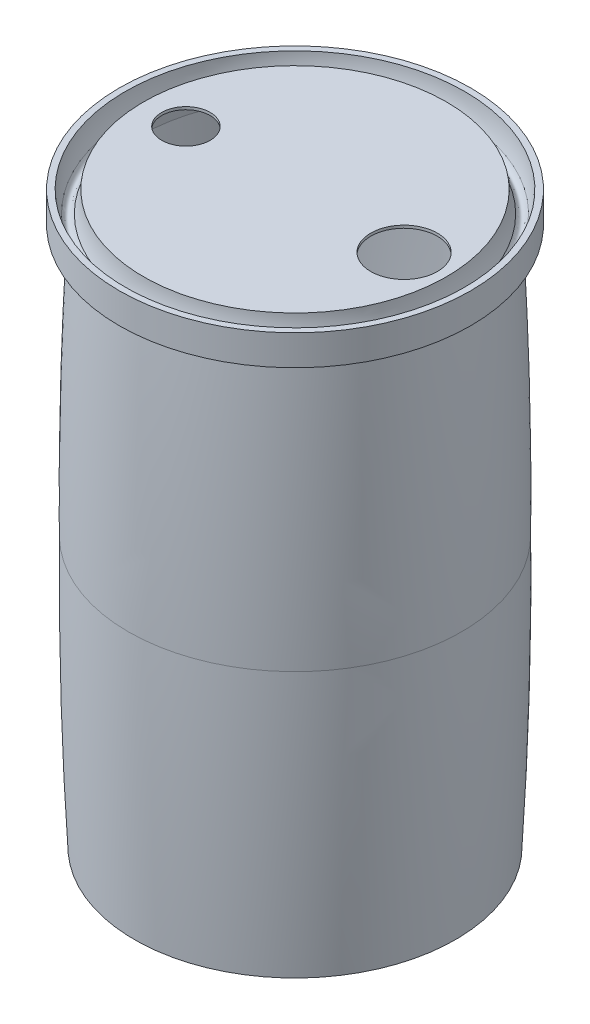
ISO-10303-21;
HEADER;
FILE_DESCRIPTION(('STEP AP214'),'2;1');
FILE_NAME('part.step','',(''),(''),'','','');
FILE_SCHEMA(('AUTOMOTIVE_DESIGN { 1 0 10303 214 1 1 1 1 }'));
ENDSEC;
DATA;
#1=APPLICATION_CONTEXT('core data for automotive mechanical design processes');
#2=APPLICATION_PROTOCOL_DEFINITION('international standard','automotive_design',2000,#1);
#3=PRODUCT_CONTEXT('',#1,'mechanical');
#4=PRODUCT('Part','Part','',(#3));
#5=PRODUCT_RELATED_PRODUCT_CATEGORY('part','',(#4));
#6=PRODUCT_DEFINITION_FORMATION('','',#4);
#7=PRODUCT_DEFINITION_CONTEXT('part definition',#1,'design');
#8=PRODUCT_DEFINITION('design','',#6,#7);
#9=PRODUCT_DEFINITION_SHAPE('','',#8);
#10=(LENGTH_UNIT() NAMED_UNIT(*) SI_UNIT(.MILLI.,.METRE.));
#11=(NAMED_UNIT(*) PLANE_ANGLE_UNIT() SI_UNIT($,.RADIAN.));
#12=(NAMED_UNIT(*) SI_UNIT($,.STERADIAN.) SOLID_ANGLE_UNIT());
#13=UNCERTAINTY_MEASURE_WITH_UNIT(LENGTH_MEASURE(1.E-05),#10,'distance_accuracy_value','');
#14=(GEOMETRIC_REPRESENTATION_CONTEXT(3) GLOBAL_UNCERTAINTY_ASSIGNED_CONTEXT((#13)) GLOBAL_UNIT_ASSIGNED_CONTEXT((#10,
#11,#12)) REPRESENTATION_CONTEXT('',''));
#15=CARTESIAN_POINT('',(0.,0.,0.));
#16=DIRECTION('',(0.,0.,1.));
#17=DIRECTION('',(1.,0.,0.));
#18=AXIS2_PLACEMENT_3D('',#15,#16,#17);
#19=CARTESIAN_POINT('',(255.01443726438,889.462843735034,0.));
#20=CARTESIAN_POINT('',(257.005357596865,852.452273109145,0.));
#21=CARTESIAN_POINT('',(260.409385389881,778.387955646829,0.));
#22=CARTESIAN_POINT('',(263.774793279568,667.290811370886,0.));
#23=CARTESIAN_POINT('',(265.401957490092,556.163604753236,0.));
#24=CARTESIAN_POINT('',(265.326354988854,482.050777888006,0.));
#25=CARTESIAN_POINT('',(264.999611150349,445.,0.));
#26=B_SPLINE_CURVE_WITH_KNOTS('',3,(#19,#20,#21,#22,#23,#24,#25),.UNSPECIFIED.,.F.,.F.,(4,1,1,1,
4),(0.,0.250049517714542,0.500099035429085,0.750148553143627,1.00019807085817),.UNSPECIFIED.);
#27=CARTESIAN_POINT('',(0.,0.,0.));
#28=DIRECTION('',(0.,-1.,0.));
#29=AXIS1_PLACEMENT('',#27,#28);
#30=SURFACE_OF_REVOLUTION('',#26,#29);
#31=CARTESIAN_POINT('',(0.,889.462843735034,0.));
#32=DIRECTION('',(0.,-1.,0.));
#33=DIRECTION('',(0.,0.,-1.));
#34=AXIS2_PLACEMENT_3D('',#31,#32,#33);
#35=CIRCLE('',#34,255.01443726438);
#36=CARTESIAN_POINT('',(0.,889.462843735034,-255.01443726438));
#37=VERTEX_POINT('',#36);
#38=EDGE_CURVE('E118',#37,#37,#35,.T.);
#39=ORIENTED_EDGE('',*,*,#38,.F.);
#40=EDGE_LOOP('',(#39));
#41=FACE_BOUND('',#40,.T.);
#42=CARTESIAN_POINT('',(0.,445.,0.));
#43=DIRECTION('',(0.,-1.,0.));
#44=DIRECTION('',(0.,0.,-1.));
#45=AXIS2_PLACEMENT_3D('',#42,#43,#44);
#46=CIRCLE('',#45,264.999611150349);
#47=CARTESIAN_POINT('',(0.,445.,-264.999611150349));
#48=VERTEX_POINT('',#47);
#49=EDGE_CURVE('E10',#48,#48,#46,.T.);
#50=ORIENTED_EDGE('',*,*,#49,.T.);
#51=EDGE_LOOP('',(#50));
#52=FACE_BOUND('',#51,.T.);
#53=CARTESIAN_POINT('',(-258.947815801606,780.,24.));
#54=CARTESIAN_POINT('',(-258.921939047419,780.671764485429,24.0000065439636));
#55=CARTESIAN_POINT('',(-258.898588919757,781.343526066716,23.9717853404909));
#56=CARTESIAN_POINT('',(-258.857040914579,782.682685721883,23.8590584591823));
#57=CARTESIAN_POINT('',(-258.838844258748,783.350082724524,23.7745394512465));
#58=CARTESIAN_POINT('',(-258.807576865088,784.676192894501,23.5496499263443));
#59=CARTESIAN_POINT('',(-258.794511257048,785.334896738401,23.4092237969048));
#60=CARTESIAN_POINT('',(-258.773368396006,786.638216076008,23.0735103044504));
#61=CARTESIAN_POINT('',(-258.765290846014,787.282832406284,22.8782262086985));
#62=CARTESIAN_POINT('',(-258.753831161898,788.553128541564,22.4342703120425));
#63=CARTESIAN_POINT('',(-258.750446932169,789.178816676006,22.1856223958235));
#64=CARTESIAN_POINT('',(-258.74795367358,790.407113948842,21.6366473030262));
#65=CARTESIAN_POINT('',(-258.748844705777,791.009722757504,21.3363193884367));
#66=CARTESIAN_POINT('',(-258.754384917711,792.187445625968,20.686190995988));
#67=CARTESIAN_POINT('',(-258.759033287218,792.76256558513,20.3364011974674));
#68=CARTESIAN_POINT('',(-258.771486394105,793.88137754163,19.5897843786426));
#69=CARTESIAN_POINT('',(-258.77929112387,794.425069614792,19.1929574718263));
#70=CARTESIAN_POINT('',(-258.797401932908,795.477726657492,18.3546493170213));
#71=CARTESIAN_POINT('',(-258.807710557834,795.986655605179,17.9131228921962));
#72=CARTESIAN_POINT('',(-258.830117309769,796.965584390079,16.9888810516313));
#73=CARTESIAN_POINT('',(-258.842215439165,797.435584175363,16.5061655809497));
#74=CARTESIAN_POINT('',(-258.867475769452,798.333359619019,15.502937184282));
#75=CARTESIAN_POINT('',(-258.880638016064,798.761133461411,14.982422634368));
#76=CARTESIAN_POINT('',(-258.907305059461,799.571418669379,13.9072891527074));
#77=CARTESIAN_POINT('',(-258.920809856691,799.953929976408,13.3526701768473));
#78=CARTESIAN_POINT('',(-258.947498891383,800.671806133094,12.2119453666771));
#79=CARTESIAN_POINT('',(-258.960682331022,801.007061917123,11.6257708723527));
#80=CARTESIAN_POINT('',(-258.986048294152,801.627013764886,10.4272468517763));
#81=CARTESIAN_POINT('',(-258.998230816053,801.911709748395,9.81489728399358));
#82=CARTESIAN_POINT('',(-259.021016323682,802.428514921092,8.56836891816433));
#83=CARTESIAN_POINT('',(-259.03161931503,802.66062429745,7.93419019782246));
#84=CARTESIAN_POINT('',(-259.050755070183,803.070601252303,6.64850535950412));
#85=CARTESIAN_POINT('',(-259.059287835659,803.248468874598,5.99699925551989));
#86=CARTESIAN_POINT('',(-259.073894363028,803.548667165585,4.68139287285837));
#87=CARTESIAN_POINT('',(-259.079968501734,803.671006345024,4.01729454043522));
#88=CARTESIAN_POINT('',(-259.089387219682,803.859310953915,2.68113344396124));
#89=CARTESIAN_POINT('',(-259.092731798776,803.925276380291,2.00907067947562));
#90=CARTESIAN_POINT('',(-259.09654249486,804.000359632836,0.661774268711117));
#91=CARTESIAN_POINT('',(-259.097008634874,804.009477913676,-0.0134593521635951));
#92=CARTESIAN_POINT('',(-259.095041819144,803.970802550008,-1.36229012583803));
#93=CARTESIAN_POINT('',(-259.092608865612,803.92300894892,-2.03588727988589));
#94=CARTESIAN_POINT('',(-259.084956310769,803.770938179847,-3.37589688450344));
#95=CARTESIAN_POINT('',(-259.079739821827,803.666724095697,-4.04231651312696));
#96=CARTESIAN_POINT('',(-259.066754925275,803.402599447736,-5.36399951195408));
#97=CARTESIAN_POINT('',(-259.058986519607,803.242688926311,-6.01926289064721));
#98=CARTESIAN_POINT('',(-259.041248138299,802.868312095427,-7.3139882047651));
#99=CARTESIAN_POINT('',(-259.031278148694,802.653845439903,-7.9534500399277));
#100=CARTESIAN_POINT('',(-259.009593812238,802.171884309843,-9.21203720636839));
#101=CARTESIAN_POINT('',(-258.997879463823,801.904389787792,-9.83116251942321));
#102=CARTESIAN_POINT('',(-258.973248904952,801.318099226006,-11.0450546573477));
#103=CARTESIAN_POINT('',(-258.960331986115,800.999272867285,-11.6398068242253));
#104=CARTESIAN_POINT('',(-258.933928706047,800.312693674615,-12.8003531679054));
#105=CARTESIAN_POINT('',(-258.920442344606,799.944940822704,-13.3661473340764));
#106=CARTESIAN_POINT('',(-258.893582975614,799.163109713066,-14.464777610879));
#107=CARTESIAN_POINT('',(-258.880209968899,798.749031113674,-14.9976134783901));
#108=CARTESIAN_POINT('',(-258.85429539049,797.877479509701,-16.0265500003536));
#109=CARTESIAN_POINT('',(-258.841753819208,797.420006483585,-16.522650636577));
#110=CARTESIAN_POINT('',(-258.818221440539,796.464448625479,-17.4750507911226));
#111=CARTESIAN_POINT('',(-258.807232113539,795.966325730104,-17.9313121582512));
#112=CARTESIAN_POINT('',(-258.787540018668,794.933377491121,-18.8002592870359));
#113=CARTESIAN_POINT('',(-258.778837252577,794.39855211893,-19.212945014756));
#114=CARTESIAN_POINT('',(-258.764405609917,793.296004555801,-19.9917936094221));
#115=CARTESIAN_POINT('',(-258.75867670607,792.728282666651,-20.3579569030596));
#116=CARTESIAN_POINT('',(-258.750822468704,791.563982265463,-21.0411477305917));
#117=CARTESIAN_POINT('',(-258.74869712902,790.967403802794,-21.3581753485468));
#118=CARTESIAN_POINT('',(-258.7486005924,789.750559141283,-21.9403929009754));
#119=CARTESIAN_POINT('',(-258.750623209448,789.130329568148,-22.2056593827863));
#120=CARTESIAN_POINT('',(-258.759259657612,787.869776251513,-22.6830519166078));
#121=CARTESIAN_POINT('',(-258.765873484381,787.229452527038,-22.8951780189268));
#122=CARTESIAN_POINT('',(-258.784026249574,785.933302471756,-23.2647816955471));
#123=CARTESIAN_POINT('',(-258.795565104474,785.277476404029,-23.4222601965311));
#124=CARTESIAN_POINT('',(-258.823772842072,783.955007409313,-23.6814683462965));
#125=CARTESIAN_POINT('',(-258.840441717651,783.288364497331,-23.7831980724247));
#126=CARTESIAN_POINT('',(-258.878932331727,781.950534328884,-23.9300489492559));
#127=CARTESIAN_POINT('',(-258.900742447575,781.279360591796,-23.9752963561848));
#128=CARTESIAN_POINT('',(-258.949457901682,779.935769926036,-24.0093205311536));
#129=CARTESIAN_POINT('',(-258.976363230608,779.263352999644,-23.9980974026402));
#130=CARTESIAN_POINT('',(-259.03504788752,777.922040285301,-23.9193105931978));
#131=CARTESIAN_POINT('',(-259.066827238782,777.253144514182,-23.8517466431938));
#132=CARTESIAN_POINT('',(-259.134898118908,775.923599287184,-23.6608114319911));
#133=CARTESIAN_POINT('',(-259.171189657623,775.262949849314,-23.5374400489326));
#134=CARTESIAN_POINT('',(-259.247849769012,773.953526013005,-23.2355821781526));
#135=CARTESIAN_POINT('',(-259.288224567957,773.304771587223,-23.0570106404465));
#136=CARTESIAN_POINT('',(-259.372385546644,772.024739780708,-22.6461267058711));
#137=CARTESIAN_POINT('',(-259.416171728509,771.393462410855,-22.4138142755476));
#138=CARTESIAN_POINT('',(-259.506430673974,770.152771000953,-21.8971155128121));
#139=CARTESIAN_POINT('',(-259.552903512955,769.543357575147,-21.6127277187702));
#140=CARTESIAN_POINT('',(-259.64771867574,768.350646727052,-20.9939026831849));
#141=CARTESIAN_POINT('',(-259.696061006598,767.767349403329,-20.6594652527671));
#142=CARTESIAN_POINT('',(-259.79397094675,766.628097322063,-19.9411118695568));
#143=CARTESIAN_POINT('',(-259.843543442737,766.072292472004,-19.5569588169514));
#144=CARTESIAN_POINT('',(-259.942731267254,764.995036684881,-18.7431790141839));
#145=CARTESIAN_POINT('',(-259.992346595932,764.47358586741,-18.3135521057315));
#146=CARTESIAN_POINT('',(-260.090643217707,763.468690633541,-17.4118221268581));
#147=CARTESIAN_POINT('',(-260.139324494232,762.985246891044,-16.9397183035982));
#148=CARTESIAN_POINT('',(-260.234770136377,762.059787118207,-15.9563354503948));
#149=CARTESIAN_POINT('',(-260.281534501976,761.617771088352,-15.4450564199923));
#150=CARTESIAN_POINT('',(-260.372270201656,760.777509173907,-14.385884816908));
#151=CARTESIAN_POINT('',(-260.416236057962,760.379348081862,-13.8379244985898));
#152=CARTESIAN_POINT('',(-260.500353292241,759.630630759587,-12.7101113560386));
#153=CARTESIAN_POINT('',(-260.540504662369,759.280074627262,-12.1302584662192));
#154=CARTESIAN_POINT('',(-260.616134685043,758.629127106253,-10.9427712717766));
#155=CARTESIAN_POINT('',(-260.651613449146,758.32873451987,-10.3351376308849));
#156=CARTESIAN_POINT('',(-260.717131478883,757.780316223443,-9.09639790666409));
#157=CARTESIAN_POINT('',(-260.747170772092,757.532290247913,-8.46529194235335));
#158=CARTESIAN_POINT('',(-260.80101858879,757.091545696244,-7.18730358823944));
#159=CARTESIAN_POINT('',(-260.824857267314,756.898558991378,-6.54051493646988));
#160=CARTESIAN_POINT('',(-260.865976587966,756.567696549403,-5.23278649533583));
#161=CARTESIAN_POINT('',(-260.883257248817,756.429820654964,-4.57184674637504));
#162=CARTESIAN_POINT('',(-260.910879227196,756.210218185413,-3.2405843067348));
#163=CARTESIAN_POINT('',(-260.92122079304,756.128489601068,-2.57026195268798));
#164=CARTESIAN_POINT('',(-260.934736508093,756.021790933474,-1.22504397398369));
#165=CARTESIAN_POINT('',(-260.937910687314,755.996820612565,-0.550148368487294));
#166=CARTESIAN_POINT('',(-260.937024324914,756.003803194798,0.794902738536605));
#167=CARTESIAN_POINT('',(-260.933011199088,756.035383027385,1.46506023886458));
#168=CARTESIAN_POINT('',(-260.917930219443,756.154506076104,2.80029977681328));
#169=CARTESIAN_POINT('',(-260.906862400058,756.242049019067,3.46538183919245));
#170=CARTESIAN_POINT('',(-260.877913877758,756.472445877295,4.78573972661882));
#171=CARTESIAN_POINT('',(-260.860033206949,756.615299531913,5.4410155978619));
#172=CARTESIAN_POINT('',(-260.817847565883,756.955260981222,6.73712666339913));
#173=CARTESIAN_POINT('',(-260.79354258343,757.15236887891,7.37796183027631));
#174=CARTESIAN_POINT('',(-260.739037059822,757.599356288192,8.64057819861421));
#175=CARTESIAN_POINT('',(-260.708837465931,757.849227321268,9.26236244301103));
#176=CARTESIAN_POINT('',(-260.643185371662,758.399944943395,10.4826387591368));
#177=CARTESIAN_POINT('',(-260.607732875634,758.700791490216,11.0811308501614));
#178=CARTESIAN_POINT('',(-260.532323739536,759.351297759983,12.2506668458319));
#179=CARTESIAN_POINT('',(-260.492367125039,759.700957205787,12.8217109062929));
#180=CARTESIAN_POINT('',(-260.408781902109,760.446607655298,13.9324179993289));
#181=CARTESIAN_POINT('',(-260.365153277181,760.842598867127,14.4720808909225));
#182=CARTESIAN_POINT('',(-260.274834637773,761.680769289855,15.519619352167));
#183=CARTESIAN_POINT('',(-260.228127036791,762.123224282825,16.0272727603744));
#184=CARTESIAN_POINT('',(-260.132852851039,763.049116569213,17.0035334404056));
#185=CARTESIAN_POINT('',(-260.084286252224,763.532554172298,17.4721404171376));
#186=CARTESIAN_POINT('',(-259.986252995799,764.537157679901,18.3671773613662));
#187=CARTESIAN_POINT('',(-259.936786104022,765.058333508261,18.7935961645688));
#188=CARTESIAN_POINT('',(-259.837932734349,766.134658686022,19.601146981874));
#189=CARTESIAN_POINT('',(-259.788546255489,766.68980762529,19.9822795425209));
#190=CARTESIAN_POINT('',(-259.690514590917,767.833462921382,20.6986283970257));
#191=CARTESIAN_POINT('',(-259.641875198399,768.422140616035,21.0335720022493));
#192=CARTESIAN_POINT('',(-259.546527566433,769.62585072063,21.6526004151669));
#193=CARTESIAN_POINT('',(-259.499819453701,770.240884854501,21.9366818897479));
#194=CARTESIAN_POINT('',(-259.409214520803,771.492302607803,22.4516449577958));
#195=CARTESIAN_POINT('',(-259.365314834573,772.128663418231,22.6825814331089));
#196=CARTESIAN_POINT('',(-259.281021168225,773.418614913239,23.0898866708755));
#197=CARTESIAN_POINT('',(-259.240626325427,774.072201305988,23.2662688888657));
#198=CARTESIAN_POINT('',(-259.152153916689,775.595367925336,23.6089269145805));
#199=CARTESIAN_POINT('',(-259.105534154029,776.46955847044,23.7554124284741));
#200=CARTESIAN_POINT('',(-259.020418426675,778.229167709217,23.9509445471098));
#201=CARTESIAN_POINT('',(-258.981922443394,779.114586377195,23.999991374783));
#202=CARTESIAN_POINT('',(-258.947815801606,780.,24.));
#203=B_SPLINE_CURVE_WITH_KNOTS('',3,(#53,#54,#55,#56,#57,#58,#59,#60,#61,#62,#63,#64,#65,#66,
#67,#68,#69,#70,#71,#72,#73,#74,#75,#76,#77,#78,#79,#80,#81,#82,#83,#84,#85,#86,#87,#88,#89,#90,
#91,#92,#93,#94,#95,#96,#97,#98,#99,#100,#101,#102,#103,#104,#105,#106,#107,#108,#109,#110,#111,
#112,#113,#114,#115,#116,#117,#118,#119,#120,#121,#122,#123,#124,#125,#126,#127,#128,#129,#130,
#131,#132,#133,#134,#135,#136,#137,#138,#139,#140,#141,#142,#143,#144,#145,#146,#147,#148,#149,
#150,#151,#152,#153,#154,#155,#156,#157,#158,#159,#160,#161,#162,#163,#164,#165,#166,#167,#168,
#169,#170,#171,#172,#173,#174,#175,#176,#177,#178,#179,#180,#181,#182,#183,#184,#185,#186,#187,
#188,#189,#190,#191,#192,#193,#194,#195,#196,#197,#198,#199,#200,#201,#202),.UNSPECIFIED.,.T.,
.F.,(4,2,2,2,2,2,2,2,2,2,2,2,2,2,2,2,2,2,2,2,2,2,2,2,2,2,2,2,2,2,2,2,2,2,2,2,2,2,2,2,2,2,2,2,2,
2,2,2,2,2,2,2,2,2,2,2,2,2,2,2,2,2,2,2,2,2,2,2,2,2,2,2,2,2,4),(0.,2.01601791061391,
4.0325133403366,6.05101966980045,8.06940580535587,10.0868904246688,12.1044038568671,
14.1214823500354,16.1385559766329,18.1576889628318,20.1768246423802,22.196047119622,
24.2152722087487,26.2390839181558,28.26289883877,30.2867065560087,32.3105126390294,
34.3340084320521,36.3575043355364,38.3809840547985,40.4044622302768,42.4256826100062,
44.4469014515871,46.4681331146845,48.4893665889299,50.5117983077566,52.5342307690815,
54.5566781473264,56.5791265291512,58.6034908957243,60.6278568388354,62.6522042136518,
64.6765481252012,66.6978752463493,68.7192004538838,70.7404913832692,72.7617795082769,
74.7785412633268,76.7952993239309,78.8120670163118,80.8288391124768,82.8487341828596,
84.8686305106502,86.8885835407537,88.9085441938319,90.938520090172,92.9685030529081,
94.998522001113,97.0285409731063,99.0624184814507,101.09630017258,103.13013329603,
105.16395610816,107.187694782066,109.211427678638,111.23508815213,113.258740152094,
115.269090936682,117.279431908314,119.289763406467,121.300098721089,123.310111240078,
125.320122093893,127.330121536059,129.340130007535,131.362826640416,133.385538558356,
135.408784324607,137.432005670509,139.466702322387,141.50153226388,143.534251349465,
145.566468674443,148.223670483342,150.880866212792),.UNSPECIFIED.);
#204=CARTESIAN_POINT('',(-258.947815801606,780.,24.));
#205=VERTEX_POINT('',#204);
#206=EDGE_CURVE('E182',#205,#205,#203,.T.);
#207=ORIENTED_EDGE('',*,*,#206,.T.);
#208=EDGE_LOOP('',(#207));
#209=FACE_BOUND('',#208,.T.);
#210=ADVANCED_FACE('F31',(#41,#52,#209),#30,.F.);
#211=CARTESIAN_POINT('',(265.,890.,0.));
#212=CARTESIAN_POINT('',(276.963146392743,667.608944339974,0.));
#213=CARTESIAN_POINT('',(275.,445.,0.));
#214=B_SPLINE_CURVE_WITH_KNOTS('',2,(#211,#212,#213),.UNSPECIFIED.,.F.,.F.,(3,3),(0.,1.),.UNSPECIFIED.);
#215=CARTESIAN_POINT('',(0.,0.,0.));
#216=DIRECTION('',(0.,-1.,0.));
#217=AXIS1_PLACEMENT('',#215,#216);
#218=SURFACE_OF_REVOLUTION('',#214,#217);
#219=CARTESIAN_POINT('',(0.,445.,0.));
#220=DIRECTION('',(0.,-1.,0.));
#221=DIRECTION('',(0.,0.,-1.));
#222=AXIS2_PLACEMENT_3D('',#219,#220,#221);
#223=CIRCLE('',#222,275.);
#224=CARTESIAN_POINT('',(0.,445.,-275.));
#225=VERTEX_POINT('',#224);
#226=EDGE_CURVE('E149',#225,#225,#223,.T.);
#227=ORIENTED_EDGE('',*,*,#226,.F.);
#228=EDGE_LOOP('',(#227));
#229=FACE_BOUND('',#228,.T.);
#230=CARTESIAN_POINT('',(0.,890.,0.));
#231=DIRECTION('',(0.,-1.,0.));
#232=DIRECTION('',(0.,0.,-1.));
#233=AXIS2_PLACEMENT_3D('',#230,#231,#232);
#234=CIRCLE('',#233,265.);
#235=CARTESIAN_POINT('',(0.,890.,-265.));
#236=VERTEX_POINT('',#235);
#237=EDGE_CURVE('E146',#236,#236,#234,.T.);
#238=ORIENTED_EDGE('',*,*,#237,.T.);
#239=EDGE_LOOP('',(#238));
#240=FACE_BOUND('',#239,.T.);
#241=CARTESIAN_POINT('',(-268.996449855096,780.,24.));
#242=CARTESIAN_POINT('',(-268.970611824207,780.671930589744,24.0000064198458));
#243=CARTESIAN_POINT('',(-268.94720387706,781.343855821716,23.9717713137008));
#244=CARTESIAN_POINT('',(-268.905349432731,782.68333496737,23.8589900674936));
#245=CARTESIAN_POINT('',(-268.886904120509,783.350887799968,23.7744304951942));
#246=CARTESIAN_POINT('',(-268.854955360107,784.677306292913,23.5494334655099));
#247=CARTESIAN_POINT('',(-268.841456893982,785.33616255475,23.4089399714855));
#248=CARTESIAN_POINT('',(-268.819277243094,786.639777217614,23.0730658648871));
#249=CARTESIAN_POINT('',(-268.810595769329,787.284536462179,22.8776885461901));
#250=CARTESIAN_POINT('',(-268.797775136004,788.555110651061,22.433519553027));
#251=CARTESIAN_POINT('',(-268.793633967904,789.180933853058,22.1847515558009));
#252=CARTESIAN_POINT('',(-268.789495721127,790.409488725945,21.6355102322825));
#253=CARTESIAN_POINT('',(-268.789498702083,791.012220064418,21.3350361619976));
#254=CARTESIAN_POINT('',(-268.793157711678,792.190170639816,20.6845909856697));
#255=CARTESIAN_POINT('',(-268.796812942307,792.765395857998,20.3346307065941));
#256=CARTESIAN_POINT('',(-268.807203192326,793.88439906206,19.587649172176));
#257=CARTESIAN_POINT('',(-268.813938203798,794.428177128777,19.1906280378145));
#258=CARTESIAN_POINT('',(-268.829861521675,795.480911435609,18.3519667260348));
#259=CARTESIAN_POINT('',(-268.839051994676,795.989836422185,17.9102873590536));
#260=CARTESIAN_POINT('',(-268.859208068895,796.968740721173,16.9857323664866));
#261=CARTESIAN_POINT('',(-268.870173672356,797.43871998436,16.5028566888315));
#262=CARTESIAN_POINT('',(-268.893187025242,798.336435123589,15.4993038164064));
#263=CARTESIAN_POINT('',(-268.905234820699,798.764169201053,14.9786250138123));
#264=CARTESIAN_POINT('',(-268.929722954659,799.574353924477,13.9031624058262));
#265=CARTESIAN_POINT('',(-268.942163293632,799.956804516205,13.3483785595902));
#266=CARTESIAN_POINT('',(-268.966799236286,800.674472842766,12.2074290416921));
#267=CARTESIAN_POINT('',(-268.978994273407,801.009590071735,11.621200134778));
#268=CARTESIAN_POINT('',(-269.002492809608,801.629261025332,10.4225830505593));
#269=CARTESIAN_POINT('',(-269.013796307389,801.913814676367,9.81019483518372));
#270=CARTESIAN_POINT('',(-269.034958547622,802.430333255088,8.56360564901702));
#271=CARTESIAN_POINT('',(-269.044817294605,802.662298347737,7.929404746657));
#272=CARTESIAN_POINT('',(-269.062620854353,803.071986809683,6.64369242380895));
#273=CARTESIAN_POINT('',(-269.070565668438,803.249710216393,5.99218101526103));
#274=CARTESIAN_POINT('',(-269.084170211992,803.549633815555,4.67653016192284));
#275=CARTESIAN_POINT('',(-269.089830117809,803.671838293031,4.0123916958291));
#276=CARTESIAN_POINT('',(-269.09860528409,803.859869224659,2.67616423596876));
#277=CARTESIAN_POINT('',(-269.101720544322,803.925695673671,2.00407524147722));
#278=CARTESIAN_POINT('',(-269.105264213507,804.000498303285,0.656738709792953));
#279=CARTESIAN_POINT('',(-269.105692641844,804.009474894005,-0.0185088045789046));
#280=CARTESIAN_POINT('',(-269.103843200895,803.970514467414,-1.36735586345132));
#281=CARTESIAN_POINT('',(-269.101565333454,803.922577488868,-2.040955409074));
#282=CARTESIAN_POINT('',(-269.094410645098,803.770208697696,-3.38105032663559));
#283=CARTESIAN_POINT('',(-269.089536374841,803.665832328532,-4.04755201705986));
#284=CARTESIAN_POINT('',(-269.077413638244,803.401367216492,-5.3693862852154));
#285=CARTESIAN_POINT('',(-269.070165173475,803.241278510496,-6.02471887034021));
#286=CARTESIAN_POINT('',(-269.053629762874,802.866530046806,-7.31956792376239));
#287=CARTESIAN_POINT('',(-269.04434280502,802.651869967256,-7.95908429875295));
#288=CARTESIAN_POINT('',(-269.02416836217,802.169507545218,-9.21776401181623));
#289=CARTESIAN_POINT('',(-269.013280875905,801.901805160654,-9.83692733374366));
#290=CARTESIAN_POINT('',(-268.990425840311,801.315105443779,-11.0508355415358));
#291=CARTESIAN_POINT('',(-268.978457726323,800.996081225549,-11.6455674223924));
#292=CARTESIAN_POINT('',(-268.954045923976,800.3091018621,-12.8060552251077));
#293=CARTESIAN_POINT('',(-268.941602235459,799.941146700636,-13.3718111373465));
#294=CARTESIAN_POINT('',(-268.916892457826,799.158909410286,-14.4703441693603));
#295=CARTESIAN_POINT('',(-268.904626369845,798.744626985597,-15.0031210785281));
#296=CARTESIAN_POINT('',(-268.880958294536,797.872669117481,-16.031917605185));
#297=CARTESIAN_POINT('',(-268.869556307554,797.414993656585,-16.5279372078769));
#298=CARTESIAN_POINT('',(-268.848305744058,796.459104441568,-17.4800835861718));
#299=CARTESIAN_POINT('',(-268.83845842387,795.960858390121,-17.9361779669123));
#300=CARTESIAN_POINT('',(-268.821016761759,794.927683008199,-18.8047802443846));
#301=CARTESIAN_POINT('',(-268.813422421344,794.392753653174,-19.2172881119472));
#302=CARTESIAN_POINT('',(-268.801141642827,793.290019126578,-19.9957721004954));
#303=CARTESIAN_POINT('',(-268.796455179238,792.722214243219,-20.3617486293208));
#304=CARTESIAN_POINT('',(-268.790589191526,791.557770331449,-21.0445594535532));
#305=CARTESIAN_POINT('',(-268.789409661837,790.9611313488,-21.3613938269507));
#306=CARTESIAN_POINT('',(-268.791078876774,789.744140032418,-21.9432449307575));
#307=CARTESIAN_POINT('',(-268.793921940901,789.123822339474,-22.2083341318144));
#308=CARTESIAN_POINT('',(-268.804051438147,787.863111640784,-22.6853633540285));
#309=CARTESIAN_POINT('',(-268.811337867222,787.222718653306,-22.8973034235514));
#310=CARTESIAN_POINT('',(-268.830668029915,785.926446800501,-23.2665292581973));
#311=CARTESIAN_POINT('',(-268.842711689936,785.270568174892,-23.423815868769));
#312=CARTESIAN_POINT('',(-268.871746199265,783.948009512452,-23.6826361884853));
#313=CARTESIAN_POINT('',(-268.888737042571,783.281329488726,-23.7841699652663));
#314=CARTESIAN_POINT('',(-268.927683192782,781.943280375627,-23.9306438096845));
#315=CARTESIAN_POINT('',(-268.9496284809,781.271923363124,-23.9756969030855));
#316=CARTESIAN_POINT('',(-268.998420996803,779.927976463752,-24.0093032574382));
#317=CARTESIAN_POINT('',(-269.025268216446,779.255386578931,-23.9978566122432));
#318=CARTESIAN_POINT('',(-269.083644926664,777.913739134422,-23.9185930764935));
#319=CARTESIAN_POINT('',(-269.115174440655,777.244681592416,-23.8507759040183));
#320=CARTESIAN_POINT('',(-269.18256089498,775.914826087856,-23.6593037088781));
#321=CARTESIAN_POINT('',(-269.218417844428,775.254028142701,-23.5356485686146));
#322=CARTESIAN_POINT('',(-269.29403554668,773.944319683303,-23.2331905382461));
#323=CARTESIAN_POINT('',(-269.333802279798,773.295429239352,-23.0543022414507));
#324=CARTESIAN_POINT('',(-269.416590856216,772.015146357719,-22.6427524854205));
#325=CARTESIAN_POINT('',(-269.459612701663,771.383753931578,-22.4100909907185));
#326=CARTESIAN_POINT('',(-269.54820757635,770.14286015401,-21.8926630191348));
#327=CARTESIAN_POINT('',(-269.593780673114,769.5333593827,-21.6078951626806));
#328=CARTESIAN_POINT('',(-269.686685456068,768.340507291782,-20.9882810044522));
#329=CARTESIAN_POINT('',(-269.734017148441,767.757156064134,-20.653434526584));
#330=CARTESIAN_POINT('',(-269.829802278273,766.618010132776,-19.9343456825938));
#331=CARTESIAN_POINT('',(-269.878259910253,766.062356269288,-19.5498807411027));
#332=CARTESIAN_POINT('',(-269.975163420233,764.985428182129,-18.7354848027764));
#333=CARTESIAN_POINT('',(-270.023609298193,764.464154071333,-18.3055536566797));
#334=CARTESIAN_POINT('',(-270.119544210625,763.459641497328,-17.4032283062919));
#335=CARTESIAN_POINT('',(-270.167033229491,762.976403654137,-16.9308334100828));
#336=CARTESIAN_POINT('',(-270.260104074723,762.0513857651,-15.9468868134168));
#337=CARTESIAN_POINT('',(-270.305685901215,761.609605716521,-15.4353351155417));
#338=CARTESIAN_POINT('',(-270.39408712731,760.769932972815,-14.3757516152528));
#339=CARTESIAN_POINT('',(-270.436901714857,760.372115917066,-13.8276594632569));
#340=CARTESIAN_POINT('',(-270.518791571956,759.62409513915,-12.6996259263399));
#341=CARTESIAN_POINT('',(-270.557866834482,759.273891506422,-12.1196844815945));
#342=CARTESIAN_POINT('',(-270.631449870926,758.623652176888,-10.932065389111));
#343=CARTESIAN_POINT('',(-270.665957749197,758.323615333854,-10.3243883754881));
#344=CARTESIAN_POINT('',(-270.729666425193,757.775906075158,-9.08560851998599));
#345=CARTESIAN_POINT('',(-270.758867248429,757.528233407782,-8.45450579073109));
#346=CARTESIAN_POINT('',(-270.811203630625,757.088137403002,-7.1764318626687));
#347=CARTESIAN_POINT('',(-270.834367304235,756.895457553085,-6.52955014045054));
#348=CARTESIAN_POINT('',(-270.874307441151,756.565217488938,-5.22167245363929));
#349=CARTESIAN_POINT('',(-270.891083921969,756.427657123603,-4.56067652774435));
#350=CARTESIAN_POINT('',(-270.917882488886,756.208688901009,-3.22933516032049));
#351=CARTESIAN_POINT('',(-270.927904802434,756.127279152868,-2.55899003440307));
#352=CARTESIAN_POINT('',(-270.940975744757,756.02121747965,-1.21375770058417));
#353=CARTESIAN_POINT('',(-270.944024400977,755.996565331201,-0.538870510568604));
#354=CARTESIAN_POINT('',(-270.943084045075,756.004179945083,0.806383937214213));
#355=CARTESIAN_POINT('',(-270.939138600951,756.036094340099,1.47675324746526));
#356=CARTESIAN_POINT('',(-270.924380199071,756.155922454907,2.81238907601371));
#357=CARTESIAN_POINT('',(-270.913567273,756.243835916327,3.47765561784015));
#358=CARTESIAN_POINT('',(-270.885308431584,756.47500861969,4.79835416893158));
#359=CARTESIAN_POINT('',(-270.867862545153,756.618267620378,5.45378622105274));
#360=CARTESIAN_POINT('',(-270.826714126748,756.959073768771,6.75017901572286));
#361=CARTESIAN_POINT('',(-270.803011583516,757.15662101415,7.39113973223337));
#362=CARTESIAN_POINT('',(-270.7498611535,757.604525057662,8.65398710652688));
#363=CARTESIAN_POINT('',(-270.720414065162,757.854874517105,9.27587640119882));
#364=CARTESIAN_POINT('',(-270.656396918992,758.406582842687,10.4963234690929));
#365=CARTESIAN_POINT('',(-270.621826865094,758.70794166967,11.0948812602246));
#366=CARTESIAN_POINT('',(-270.548288638519,759.35950291791,12.2645022201744));
#367=CARTESIAN_POINT('',(-270.509320499295,759.709704967666,12.8355655980713));
#368=CARTESIAN_POINT('',(-270.427791589836,760.456467081772,13.9462594107857));
#369=CARTESIAN_POINT('',(-270.385230804526,760.853027340646,14.4858897136921));
#370=CARTESIAN_POINT('',(-270.297120889473,761.692213833014,15.5331218812192));
#371=CARTESIAN_POINT('',(-270.251555451479,762.135100692307,16.0405135398292));
#372=CARTESIAN_POINT('',(-270.158587672717,763.061841796904,17.0162132778825));
#373=CARTESIAN_POINT('',(-270.111185318434,763.545696343704,17.4845210696415));
#374=CARTESIAN_POINT('',(-270.015471110055,764.551112762916,18.3789200766127));
#375=CARTESIAN_POINT('',(-269.967159019289,765.072684550707,18.8050001203954));
#376=CARTESIAN_POINT('',(-269.87057388473,766.149773511453,19.6118331693989));
#377=CARTESIAN_POINT('',(-269.822300840467,766.705290268223,19.9925867301799));
#378=CARTESIAN_POINT('',(-269.726442188501,767.84950496752,20.7080467745648));
#379=CARTESIAN_POINT('',(-269.678861727052,768.438366483655,21.0424924042422));
#380=CARTESIAN_POINT('',(-269.585528875764,769.64238938065,21.6605137724227));
#381=CARTESIAN_POINT('',(-269.539776606145,770.257552485578,21.9440861698383));
#382=CARTESIAN_POINT('',(-269.450952304556,771.509167009145,22.4580250708479));
#383=CARTESIAN_POINT('',(-269.407877529376,772.145595576755,22.6884467086851));
#384=CARTESIAN_POINT('',(-269.325079814899,773.435623424824,23.0947243750093));
#385=CARTESIAN_POINT('',(-269.285356047147,774.089218408601,23.2705939191112));
#386=CARTESIAN_POINT('',(-269.198383594513,775.609695243123,23.6114879243179));
#387=CARTESIAN_POINT('',(-269.152510807367,776.481098204654,23.7570164527529));
#388=CARTESIAN_POINT('',(-269.068511391752,778.235003872338,23.9512681814624));
#389=CARTESIAN_POINT('',(-269.03038474835,779.117506557088,23.9999915683675));
#390=CARTESIAN_POINT('',(-268.996449855096,780.,24.));
#391=B_SPLINE_CURVE_WITH_KNOTS('',3,(#241,#242,#243,#244,#245,#246,#247,#248,#249,#250,#251,
#252,#253,#254,#255,#256,#257,#258,#259,#260,#261,#262,#263,#264,#265,#266,#267,#268,#269,#270,
#271,#272,#273,#274,#275,#276,#277,#278,#279,#280,#281,#282,#283,#284,#285,#286,#287,#288,#289,
#290,#291,#292,#293,#294,#295,#296,#297,#298,#299,#300,#301,#302,#303,#304,#305,#306,#307,#308,
#309,#310,#311,#312,#313,#314,#315,#316,#317,#318,#319,#320,#321,#322,#323,#324,#325,#326,#327,
#328,#329,#330,#331,#332,#333,#334,#335,#336,#337,#338,#339,#340,#341,#342,#343,#344,#345,#346,
#347,#348,#349,#350,#351,#352,#353,#354,#355,#356,#357,#358,#359,#360,#361,#362,#363,#364,#365,
#366,#367,#368,#369,#370,#371,#372,#373,#374,#375,#376,#377,#378,#379,#380,#381,#382,#383,#384,
#385,#386,#387,#388,#389,#390),.UNSPECIFIED.,.T.,.F.,(4,2,2,2,2,2,2,2,2,2,2,2,2,2,2,2,2,2,2,2,2,
2,2,2,2,2,2,2,2,2,2,2,2,2,2,2,2,2,2,2,2,2,2,2,2,2,2,2,2,2,2,2,2,2,2,2,2,2,2,2,2,2,2,2,2,2,2,2,2,
2,2,2,2,2,4),(0.,2.01651381091937,4.03350869153427,6.05252937652809,8.07142891498067,
10.089434972403,12.1074700691014,14.1250643259818,16.1426533962697,18.1620286148219,
20.1814063857618,22.2008700942568,24.220336221292,26.2440279376677,28.2677225993255,
30.2914109127912,32.3150978304325,34.3386285306962,36.3621594154725,38.3856757023887,
40.4091906110752,42.4307213135072,44.4522506777077,46.4737919649591,48.4953348557816,
50.5179402397868,52.540546295279,54.5631652660059,56.5857850509657,58.6100310418409,
60.6342783873799,62.65850798949,64.6827343790432,66.704105112033,68.7254740055727,
70.7468116286345,72.7681467995109,74.7854305048384,76.8027108592006,78.8200013024502,
80.837295994262,82.8577257721439,84.8781568826507,86.8986414940093,88.9191332102684,
90.9490256573414,92.9789247685735,95.0088569616343,97.0387890208585,99.0721609681494,
101.105536734973,103.138866036218,105.172185563045,107.195859648646,109.219528186476,
111.243128573609,113.266720996787,115.277752216696,117.288774158092,119.299787333429,
121.31080412692,123.321541604186,125.332277537956,127.342998178852,129.35372725727,
131.376448017314,133.399183664668,135.422453010049,137.44569755396,139.479911857568,
141.514259708851,143.546487708026,145.578211807384,148.226645549891,150.87507418648),.UNSPECIFIED.);
#392=CARTESIAN_POINT('',(-268.996449855096,780.,24.));
#393=VERTEX_POINT('',#392);
#394=EDGE_CURVE('E36',#393,#393,#391,.T.);
#395=ORIENTED_EDGE('',*,*,#394,.F.);
#396=EDGE_LOOP('',(#395));
#397=FACE_BOUND('',#396,.T.);
#398=ADVANCED_FACE('F171',(#229,#240,#397),#218,.T.);
#399=CARTESIAN_POINT('',(264.999611150349,445.,0.));
#400=CARTESIAN_POINT('',(265.319396023728,408.738326727968,0.));
#401=CARTESIAN_POINT('',(265.405469834809,336.204089877467,0.));
#402=CARTESIAN_POINT('',(263.867352766553,227.443147550638,0.));
#403=CARTESIAN_POINT('',(260.664239222919,118.710725145291,0.));
#404=CARTESIAN_POINT('',(257.417373097272,46.2235226087697,0.));
#405=CARTESIAN_POINT('',(255.517157181419,10.,0.));
#406=B_SPLINE_CURVE_WITH_KNOTS('',3,(#399,#400,#401,#402,#403,#404,#405),.UNSPECIFIED.,.F.,.F.,
(4,1,1,1,4),(0.0213049052625531,0.266028196661457,0.510751488060362,0.755474779459266,
1.00019807085817),.UNSPECIFIED.);
#407=CARTESIAN_POINT('',(0.,0.,0.));
#408=DIRECTION('',(0.,-1.,0.));
#409=AXIS1_PLACEMENT('',#407,#408);
#410=SURFACE_OF_REVOLUTION('',#406,#409);
#411=CARTESIAN_POINT('',(0.,10.,0.));
#412=DIRECTION('',(0.,-1.,0.));
#413=DIRECTION('',(0.,0.,-1.));
#414=AXIS2_PLACEMENT_3D('',#411,#412,#413);
#415=CIRCLE('',#414,255.517157181419);
#416=CARTESIAN_POINT('',(0.,10.,-255.517157181419));
#417=VERTEX_POINT('',#416);
#418=EDGE_CURVE('E44',#417,#417,#415,.T.);
#419=ORIENTED_EDGE('',*,*,#418,.T.);
#420=EDGE_LOOP('',(#419));
#421=FACE_BOUND('',#420,.T.);
#422=ORIENTED_EDGE('',*,*,#49,.F.);
#423=EDGE_LOOP('',(#422));
#424=FACE_BOUND('',#423,.T.);
#425=ADVANCED_FACE('F176',(#421,#424),#410,.F.);
#426=CARTESIAN_POINT('',(0.,10.,0.));
#427=DIRECTION('',(0.,-1.,0.));
#428=DIRECTION('',(0.,0.,-1.));
#429=AXIS2_PLACEMENT_3D('',#426,#427,#428);
#430=PLANE('',#429);
#431=ORIENTED_EDGE('',*,*,#418,.F.);
#432=EDGE_LOOP('',(#431));
#433=FACE_BOUND('',#432,.T.);
#434=ADVANCED_FACE('F95',(#433),#430,.F.);
#435=CARTESIAN_POINT('',(-4.2807593246112E-13,935.530241120405,0.));
#436=DIRECTION('',(0.,1.,0.));
#437=DIRECTION('',(0.,0.,1.));
#438=AXIS2_PLACEMENT_3D('',#435,#436,#437);
#439=PLANE('',#438);
#440=CARTESIAN_POINT('',(180.,935.530241120405,0.));
#441=DIRECTION('',(0.,1.,0.));
#442=DIRECTION('',(0.,0.,1.));
#443=AXIS2_PLACEMENT_3D('',#440,#441,#442);
#444=CIRCLE('',#443,55.);
#445=CARTESIAN_POINT('',(180.,935.530241120405,55.));
#446=VERTEX_POINT('',#445);
#447=EDGE_CURVE('E62',#446,#446,#444,.T.);
#448=ORIENTED_EDGE('',*,*,#447,.T.);
#449=EDGE_LOOP('',(#448));
#450=FACE_BOUND('',#449,.T.);
#451=CARTESIAN_POINT('',(-180.,935.530241120405,0.));
#452=DIRECTION('',(0.,1.,0.));
#453=DIRECTION('',(0.,0.,1.));
#454=AXIS2_PLACEMENT_3D('',#451,#452,#453);
#455=CIRCLE('',#454,40.);
#456=CARTESIAN_POINT('',(-180.,935.530241120405,40.));
#457=VERTEX_POINT('',#456);
#458=EDGE_CURVE('E52',#457,#457,#455,.T.);
#459=ORIENTED_EDGE('',*,*,#458,.T.);
#460=EDGE_LOOP('',(#459));
#461=FACE_BOUND('',#460,.T.);
#462=CARTESIAN_POINT('',(0.,935.530241120405,0.));
#463=DIRECTION('',(0.,-1.,0.));
#464=DIRECTION('',(0.,0.,-1.));
#465=AXIS2_PLACEMENT_3D('',#462,#463,#464);
#466=CIRCLE('',#465,242.631536875606);
#467=CARTESIAN_POINT('',(0.,935.530241120405,-242.631536875606));
#468=VERTEX_POINT('',#467);
#469=EDGE_CURVE('E124',#468,#468,#466,.T.);
#470=ORIENTED_EDGE('',*,*,#469,.T.);
#471=EDGE_LOOP('',(#470));
#472=FACE_BOUND('',#471,.T.);
#473=ADVANCED_FACE('F91',(#450,#461,#472),#439,.F.);
#474=CARTESIAN_POINT('',(0.,889.462843735034,0.));
#475=DIRECTION('',(0.,-1.,0.));
#476=DIRECTION('',(0.,0.,-1.));
#477=AXIS2_PLACEMENT_3D('',#474,#475,#476);
#478=CONICAL_SURFACE('',#477,255.01443726438,0.262592708602639);
#479=ORIENTED_EDGE('',*,*,#469,.F.);
#480=EDGE_LOOP('',(#479));
#481=FACE_BOUND('',#480,.T.);
#482=ORIENTED_EDGE('',*,*,#38,.T.);
#483=EDGE_LOOP('',(#482));
#484=FACE_BOUND('',#483,.T.);
#485=ADVANCED_FACE('F87',(#481,#484),#478,.F.);
#486=CARTESIAN_POINT('',(-180.,930.,0.));
#487=DIRECTION('',(0.,1.,0.));
#488=DIRECTION('',(0.,0.,1.));
#489=AXIS2_PLACEMENT_3D('',#486,#487,#488);
#490=CYLINDRICAL_SURFACE('',#489,40.);
#491=CARTESIAN_POINT('',(-180.,940.,0.));
#492=DIRECTION('',(0.,1.,0.));
#493=DIRECTION('',(0.,0.,1.));
#494=AXIS2_PLACEMENT_3D('',#491,#492,#493);
#495=CIRCLE('',#494,40.);
#496=CARTESIAN_POINT('',(-180.,940.,40.));
#497=VERTEX_POINT('',#496);
#498=EDGE_CURVE('E55',#497,#497,#495,.T.);
#499=ORIENTED_EDGE('',*,*,#498,.T.);
#500=EDGE_LOOP('',(#499));
#501=FACE_BOUND('',#500,.T.);
#502=ORIENTED_EDGE('',*,*,#458,.F.);
#503=EDGE_LOOP('',(#502));
#504=FACE_BOUND('',#503,.T.);
#505=ADVANCED_FACE('F90',(#501,#504),#490,.F.);
#506=CARTESIAN_POINT('',(0.,0.,0.));
#507=DIRECTION('',(0.,-1.,0.));
#508=DIRECTION('',(0.,0.,-1.));
#509=AXIS2_PLACEMENT_3D('',#506,#507,#508);
#510=PLANE('',#509);
#511=CARTESIAN_POINT('',(0.,0.,0.));
#512=DIRECTION('',(0.,-1.,0.));
#513=DIRECTION('',(0.,0.,-1.));
#514=AXIS2_PLACEMENT_3D('',#511,#512,#513);
#515=CIRCLE('',#514,265.);
#516=CARTESIAN_POINT('',(0.,0.,-265.));
#517=VERTEX_POINT('',#516);
#518=EDGE_CURVE('E49',#517,#517,#515,.T.);
#519=ORIENTED_EDGE('',*,*,#518,.T.);
#520=EDGE_LOOP('',(#519));
#521=FACE_BOUND('',#520,.T.);
#522=ADVANCED_FACE('F154',(#521),#510,.T.);
#523=CARTESIAN_POINT('',(265.,0.,0.));
#524=CARTESIAN_POINT('',(276.963146392743,222.391055660026,0.));
#525=CARTESIAN_POINT('',(275.,445.,0.));
#526=B_SPLINE_CURVE_WITH_KNOTS('',2,(#523,#524,#525),.UNSPECIFIED.,.F.,.F.,(3,3),(0.,1.),.UNSPECIFIED.);
#527=CARTESIAN_POINT('',(0.,0.,0.));
#528=DIRECTION('',(0.,-1.,0.));
#529=AXIS1_PLACEMENT('',#527,#528);
#530=SURFACE_OF_REVOLUTION('',#526,#529);
#531=ORIENTED_EDGE('',*,*,#226,.T.);
#532=EDGE_LOOP('',(#531));
#533=FACE_BOUND('',#532,.T.);
#534=ORIENTED_EDGE('',*,*,#518,.F.);
#535=EDGE_LOOP('',(#534));
#536=FACE_BOUND('',#535,.T.);
#537=ADVANCED_FACE('F156',(#533,#536),#530,.F.);
#538=CARTESIAN_POINT('',(0.,890.,0.));
#539=DIRECTION('',(0.,1.,0.));
#540=DIRECTION('',(0.,0.,1.));
#541=AXIS2_PLACEMENT_3D('',#538,#539,#540);
#542=PLANE('',#541);
#543=ORIENTED_EDGE('',*,*,#237,.F.);
#544=EDGE_LOOP('',(#543));
#545=FACE_BOUND('',#544,.T.);
#546=CARTESIAN_POINT('',(0.,890.,0.));
#547=DIRECTION('',(0.,-1.,0.));
#548=DIRECTION('',(0.,0.,-1.));
#549=AXIS2_PLACEMENT_3D('',#546,#547,#548);
#550=CIRCLE('',#549,290.);
#551=CARTESIAN_POINT('',(0.,890.,-290.));
#552=VERTEX_POINT('',#551);
#553=EDGE_CURVE('E143',#552,#552,#550,.T.);
#554=ORIENTED_EDGE('',*,*,#553,.T.);
#555=EDGE_LOOP('',(#554));
#556=FACE_BOUND('',#555,.T.);
#557=ADVANCED_FACE('F158',(#545,#556),#542,.F.);
#558=CARTESIAN_POINT('',(0.,0.,0.));
#559=DIRECTION('',(0.,-1.,0.));
#560=DIRECTION('',(0.,0.,-1.));
#561=AXIS2_PLACEMENT_3D('',#558,#559,#560);
#562=CYLINDRICAL_SURFACE('',#561,290.);
#563=ORIENTED_EDGE('',*,*,#553,.F.);
#564=EDGE_LOOP('',(#563));
#565=FACE_BOUND('',#564,.T.);
#566=CARTESIAN_POINT('',(0.,940.,0.));
#567=DIRECTION('',(0.,-1.,0.));
#568=DIRECTION('',(0.,0.,-1.));
#569=AXIS2_PLACEMENT_3D('',#566,#567,#568);
#570=CIRCLE('',#569,290.);
#571=CARTESIAN_POINT('',(0.,940.,-290.));
#572=VERTEX_POINT('',#571);
#573=EDGE_CURVE('E140',#572,#572,#570,.T.);
#574=ORIENTED_EDGE('',*,*,#573,.T.);
#575=EDGE_LOOP('',(#574));
#576=FACE_BOUND('',#575,.T.);
#577=ADVANCED_FACE('F165',(#565,#576),#562,.T.);
#578=CARTESIAN_POINT('',(0.,940.,0.));
#579=DIRECTION('',(0.,-1.,0.));
#580=DIRECTION('',(0.,0.,-1.));
#581=AXIS2_PLACEMENT_3D('',#578,#579,#580);
#582=PLANE('',#581);
#583=ORIENTED_EDGE('',*,*,#573,.F.);
#584=EDGE_LOOP('',(#583));
#585=FACE_BOUND('',#584,.T.);
#586=CARTESIAN_POINT('',(0.,940.,0.));
#587=DIRECTION('',(0.,-1.,0.));
#588=DIRECTION('',(0.,0.,-1.));
#589=AXIS2_PLACEMENT_3D('',#586,#587,#588);
#590=CIRCLE('',#589,280.);
#591=CARTESIAN_POINT('',(0.,940.,-280.));
#592=VERTEX_POINT('',#591);
#593=EDGE_CURVE('E137',#592,#592,#590,.T.);
#594=ORIENTED_EDGE('',*,*,#593,.T.);
#595=EDGE_LOOP('',(#594));
#596=FACE_BOUND('',#595,.T.);
#597=ADVANCED_FACE('F277',(#585,#596),#582,.F.);
#598=CARTESIAN_POINT('',(280.,940.,0.));
#599=CARTESIAN_POINT('',(279.46097093277,927.789264107049,0.));
#600=CARTESIAN_POINT('',(276.981413982603,916.183407303258,0.));
#601=CARTESIAN_POINT('',(272.561292401976,905.182338129134,0.));
#602=B_SPLINE_CURVE_WITH_KNOTS('',3,(#598,#599,#600,#601),.UNSPECIFIED.,.F.,.F.,(4,4),(0.,
0.679214321457902),.UNSPECIFIED.);
#603=CARTESIAN_POINT('',(0.,0.,0.));
#604=DIRECTION('',(0.,-1.,0.));
#605=AXIS1_PLACEMENT('',#603,#604);
#606=SURFACE_OF_REVOLUTION('',#602,#605);
#607=CARTESIAN_POINT('',(0.,905.182338129134,0.));
#608=DIRECTION('',(0.,-1.,0.));
#609=DIRECTION('',(0.,0.,-1.));
#610=AXIS2_PLACEMENT_3D('',#607,#608,#609);
#611=CIRCLE('',#610,272.561292401976);
#612=CARTESIAN_POINT('',(0.,905.182338129134,-272.561292401976));
#613=VERTEX_POINT('',#612);
#614=EDGE_CURVE('E134',#613,#613,#611,.T.);
#615=ORIENTED_EDGE('',*,*,#614,.T.);
#616=EDGE_LOOP('',(#615));
#617=FACE_BOUND('',#616,.T.);
#618=ORIENTED_EDGE('',*,*,#593,.F.);
#619=EDGE_LOOP('',(#618));
#620=FACE_BOUND('',#619,.T.);
#621=ADVANCED_FACE('F287',(#617,#620),#606,.F.);
#622=CARTESIAN_POINT('',(272.561292401976,905.182338129134,0.));
#623=CARTESIAN_POINT('',(265.143004648702,892.540859691794,0.));
#624=CARTESIAN_POINT('',(257.547923485371,904.911612973631,0.));
#625=B_SPLINE_CURVE_WITH_KNOTS('',2,(#622,#623,#624),.UNSPECIFIED.,.F.,.F.,(3,3),(0.,1.),.UNSPECIFIED.);
#626=CARTESIAN_POINT('',(0.,0.,0.));
#627=DIRECTION('',(0.,-1.,0.));
#628=AXIS1_PLACEMENT('',#626,#627);
#629=SURFACE_OF_REVOLUTION('',#625,#628);
#630=CARTESIAN_POINT('',(0.,904.911612973631,0.));
#631=DIRECTION('',(0.,-1.,0.));
#632=DIRECTION('',(0.,0.,-1.));
#633=AXIS2_PLACEMENT_3D('',#630,#631,#632);
#634=CIRCLE('',#633,257.547923485371);
#635=CARTESIAN_POINT('',(0.,904.911612973631,-257.547923485371));
#636=VERTEX_POINT('',#635);
#637=EDGE_CURVE('E131',#636,#636,#634,.T.);
#638=ORIENTED_EDGE('',*,*,#637,.T.);
#639=EDGE_LOOP('',(#638));
#640=FACE_BOUND('',#639,.T.);
#641=ORIENTED_EDGE('',*,*,#614,.F.);
#642=EDGE_LOOP('',(#641));
#643=FACE_BOUND('',#642,.T.);
#644=ADVANCED_FACE('F106',(#640,#643),#629,.F.);
#645=CARTESIAN_POINT('',(250.,940.,0.));
#646=CARTESIAN_POINT('',(250.543441152621,927.689084085689,0.));
#647=CARTESIAN_POINT('',(253.059415647625,915.992955077194,0.));
#648=CARTESIAN_POINT('',(257.547923485371,904.911612973631,0.));
#649=B_SPLINE_CURVE_WITH_KNOTS('',3,(#645,#646,#647,#648),.UNSPECIFIED.,.F.,.F.,(4,4),(0.,
0.684788364480041),.UNSPECIFIED.);
#650=CARTESIAN_POINT('',(0.,0.,0.));
#651=DIRECTION('',(0.,-1.,0.));
#652=AXIS1_PLACEMENT('',#650,#651);
#653=SURFACE_OF_REVOLUTION('',#649,#652);
#654=ORIENTED_EDGE('',*,*,#637,.F.);
#655=EDGE_LOOP('',(#654));
#656=FACE_BOUND('',#655,.T.);
#657=CARTESIAN_POINT('',(0.,940.,0.));
#658=DIRECTION('',(0.,-1.,0.));
#659=DIRECTION('',(0.,0.,-1.));
#660=AXIS2_PLACEMENT_3D('',#657,#658,#659);
#661=CIRCLE('',#660,250.);
#662=CARTESIAN_POINT('',(0.,940.,-250.));
#663=VERTEX_POINT('',#662);
#664=EDGE_CURVE('E128',#663,#663,#661,.T.);
#665=ORIENTED_EDGE('',*,*,#664,.T.);
#666=EDGE_LOOP('',(#665));
#667=FACE_BOUND('',#666,.T.);
#668=ADVANCED_FACE('F101',(#656,#667),#653,.T.);
#669=CARTESIAN_POINT('',(4.17443857259059E-13,940.,0.));
#670=DIRECTION('',(0.,-1.,0.));
#671=DIRECTION('',(0.,0.,-1.));
#672=AXIS2_PLACEMENT_3D('',#669,#670,#671);
#673=PLANE('',#672);
#674=CARTESIAN_POINT('',(180.,940.,0.));
#675=DIRECTION('',(0.,1.,0.));
#676=DIRECTION('',(0.,0.,1.));
#677=AXIS2_PLACEMENT_3D('',#674,#675,#676);
#678=CIRCLE('',#677,55.);
#679=CARTESIAN_POINT('',(180.,940.,55.));
#680=VERTEX_POINT('',#679);
#681=EDGE_CURVE('E67',#680,#680,#678,.T.);
#682=ORIENTED_EDGE('',*,*,#681,.F.);
#683=EDGE_LOOP('',(#682));
#684=FACE_BOUND('',#683,.T.);
#685=ORIENTED_EDGE('',*,*,#498,.F.);
#686=EDGE_LOOP('',(#685));
#687=FACE_BOUND('',#686,.T.);
#688=ORIENTED_EDGE('',*,*,#664,.F.);
#689=EDGE_LOOP('',(#688));
#690=FACE_BOUND('',#689,.T.);
#691=ADVANCED_FACE('F97',(#684,#687,#690),#673,.F.);
#692=CARTESIAN_POINT('',(180.,930.,0.));
#693=DIRECTION('',(0.,1.,0.));
#694=DIRECTION('',(0.,0.,1.));
#695=AXIS2_PLACEMENT_3D('',#692,#693,#694);
#696=CYLINDRICAL_SURFACE('',#695,55.);
#697=ORIENTED_EDGE('',*,*,#681,.T.);
#698=EDGE_LOOP('',(#697));
#699=FACE_BOUND('',#698,.T.);
#700=ORIENTED_EDGE('',*,*,#447,.F.);
#701=EDGE_LOOP('',(#700));
#702=FACE_BOUND('',#701,.T.);
#703=ADVANCED_FACE('F100',(#699,#702),#696,.F.);
#704=CARTESIAN_POINT('',(-250.,780.,0.));
#705=DIRECTION('',(-1.,0.,0.));
#706=DIRECTION('',(0.,0.,1.));
#707=AXIS2_PLACEMENT_3D('',#704,#705,#706);
#708=CYLINDRICAL_SURFACE('',#707,24.);
#709=ORIENTED_EDGE('',*,*,#206,.F.);
#710=EDGE_LOOP('',(#709));
#711=FACE_BOUND('',#710,.T.);
#712=ORIENTED_EDGE('',*,*,#394,.T.);
#713=EDGE_LOOP('',(#712));
#714=FACE_BOUND('',#713,.T.);
#715=ADVANCED_FACE('F189',(#711,#714),#708,.F.);
#716=CLOSED_SHELL('',(#210,#398,#425,#434,#473,#485,#505,#522,#537,#557,#577,#597,#621,#644,
#668,#691,#703,#715));
#717=CARTESIAN_POINT('',(247.165011325552,937.,0.));
#718=CARTESIAN_POINT('',(247.314316556932,934.836053873027,0.));
#719=CARTESIAN_POINT('',(247.524701823908,932.678918386818,0.));
#720=CARTESIAN_POINT('',(248.071680146902,928.378720030839,0.));
#721=CARTESIAN_POINT('',(248.408589174208,926.234498971027,0.));
#722=CARTESIAN_POINT('',(248.809224770535,924.104638419313,0.));
#723=B_SPLINE_CURVE_WITH_KNOTS('',3,(#717,#718,#719,#720,#721,#722),.UNSPECIFIED.,.F.,.F.,(4,2,
4),(0.,0.5,1.),.UNSPECIFIED.);
#724=CARTESIAN_POINT('',(0.,0.,0.));
#725=DIRECTION('',(0.,-1.,0.));
#726=AXIS1_PLACEMENT('',#724,#725);
#727=SURFACE_OF_REVOLUTION('',#723,#726);
#728=CARTESIAN_POINT('',(0.,924.104638419313,0.));
#729=DIRECTION('',(0.,-1.,0.));
#730=DIRECTION('',(0.,0.,-1.));
#731=AXIS2_PLACEMENT_3D('',#728,#729,#730);
#732=CIRCLE('',#731,248.809224770534);
#733=CARTESIAN_POINT('',(0.,924.104638419313,-248.809224770534));
#734=VERTEX_POINT('',#733);
#735=EDGE_CURVE('E125',#734,#734,#732,.T.);
#736=ORIENTED_EDGE('',*,*,#735,.T.);
#737=EDGE_LOOP('',(#736));
#738=FACE_BOUND('',#737,.T.);
#739=CARTESIAN_POINT('',(0.,937.,0.));
#740=DIRECTION('',(0.,-1.,0.));
#741=DIRECTION('',(0.,0.,-1.));
#742=AXIS2_PLACEMENT_3D('',#739,#740,#741);
#743=CIRCLE('',#742,247.165011325552);
#744=CARTESIAN_POINT('',(0.,937.,-247.165011325552));
#745=VERTEX_POINT('',#744);
#746=EDGE_CURVE('E54',#745,#745,#743,.T.);
#747=ORIENTED_EDGE('',*,*,#746,.F.);
#748=EDGE_LOOP('',(#747));
#749=FACE_BOUND('',#748,.T.);
#750=ADVANCED_FACE('F79',(#738,#749),#727,.F.);
#751=CARTESIAN_POINT('',(0.,924.104638419313,0.));
#752=DIRECTION('',(0.,-1.,0.));
#753=DIRECTION('',(0.,0.,-1.));
#754=AXIS2_PLACEMENT_3D('',#751,#752,#753);
#755=CONICAL_SURFACE('',#754,248.809224770534,0.262592708602729);
#756=CARTESIAN_POINT('',(0.,937.,0.));
#757=DIRECTION('',(0.,-1.,0.));
#758=DIRECTION('',(0.,0.,-1.));
#759=AXIS2_PLACEMENT_3D('',#756,#757,#758);
#760=CIRCLE('',#759,245.342956064379);
#761=CARTESIAN_POINT('',(0.,937.,-245.342956064379));
#762=VERTEX_POINT('',#761);
#763=EDGE_CURVE('E59',#762,#762,#760,.T.);
#764=ORIENTED_EDGE('',*,*,#763,.T.);
#765=EDGE_LOOP('',(#764));
#766=FACE_BOUND('',#765,.T.);
#767=ORIENTED_EDGE('',*,*,#735,.F.);
#768=EDGE_LOOP('',(#767));
#769=FACE_BOUND('',#768,.T.);
#770=ADVANCED_FACE('F83',(#766,#769),#755,.T.);
#771=CARTESIAN_POINT('',(4.16111589629509E-13,937.,0.));
#772=DIRECTION('',(0.,-1.,0.));
#773=DIRECTION('',(0.,0.,-1.));
#774=AXIS2_PLACEMENT_3D('',#771,#772,#773);
#775=PLANE('',#774);
#776=ORIENTED_EDGE('',*,*,#746,.T.);
#777=EDGE_LOOP('',(#776));
#778=FACE_BOUND('',#777,.T.);
#779=ORIENTED_EDGE('',*,*,#763,.F.);
#780=EDGE_LOOP('',(#779));
#781=FACE_BOUND('',#780,.T.);
#782=ADVANCED_FACE('F198',(#778,#781),#775,.T.);
#783=CLOSED_SHELL('',(#750,#770,#782));
#784=ORIENTED_CLOSED_SHELL('',*,#783,.T.);
#785=BREP_WITH_VOIDS('B2',#716,(#784));
#786=ADVANCED_BREP_SHAPE_REPRESENTATION('',(#18,#785),#14);
#787=SHAPE_DEFINITION_REPRESENTATION(#9,#786);
ENDSEC;
END-ISO-10303-21;
